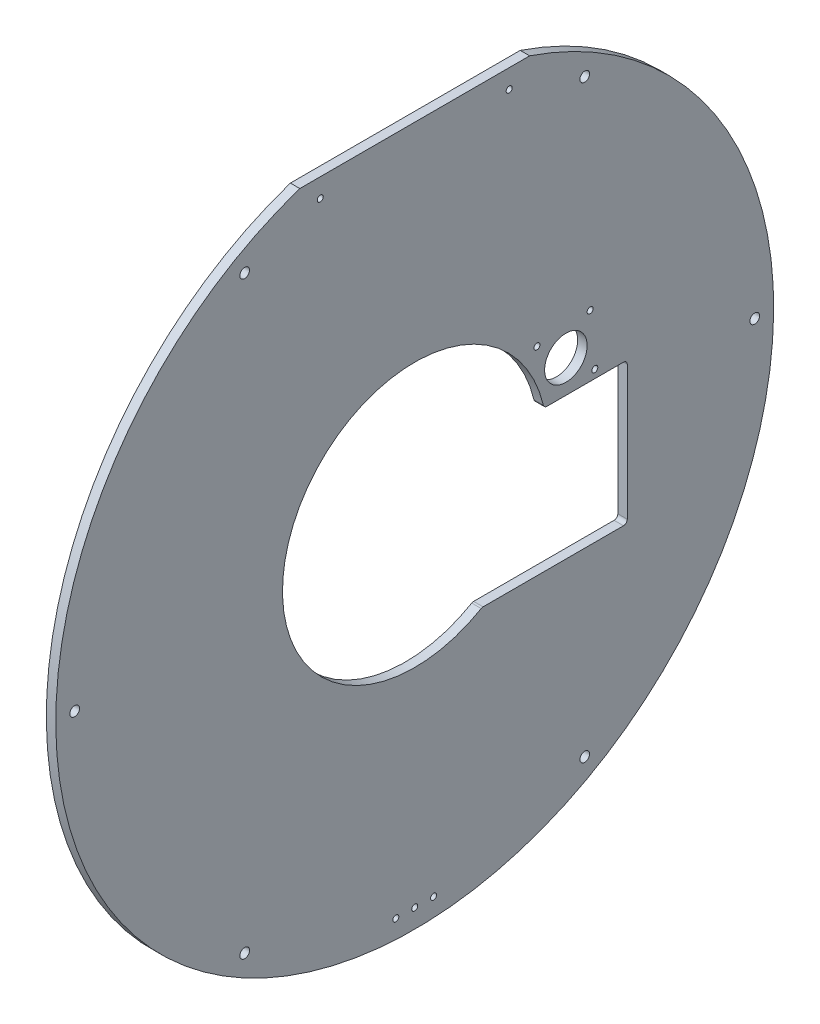
ISO-10303-21;
HEADER;
FILE_DESCRIPTION(('STEP AP214'),'2;1');
FILE_NAME('part.step','',(''),(''),'','','');
FILE_SCHEMA(('AUTOMOTIVE_DESIGN { 1 0 10303 214 1 1 1 1 }'));
ENDSEC;
DATA;
#1=APPLICATION_CONTEXT('core data for automotive mechanical design processes');
#2=APPLICATION_PROTOCOL_DEFINITION('international standard','automotive_design',2000,#1);
#3=PRODUCT_CONTEXT('',#1,'mechanical');
#4=PRODUCT('Part','Part','',(#3));
#5=PRODUCT_RELATED_PRODUCT_CATEGORY('part','',(#4));
#6=PRODUCT_DEFINITION_FORMATION('','',#4);
#7=PRODUCT_DEFINITION_CONTEXT('part definition',#1,'design');
#8=PRODUCT_DEFINITION('design','',#6,#7);
#9=PRODUCT_DEFINITION_SHAPE('','',#8);
#10=(LENGTH_UNIT() NAMED_UNIT(*) SI_UNIT(.MILLI.,.METRE.));
#11=(NAMED_UNIT(*) PLANE_ANGLE_UNIT() SI_UNIT($,.RADIAN.));
#12=(NAMED_UNIT(*) SI_UNIT($,.STERADIAN.) SOLID_ANGLE_UNIT());
#13=UNCERTAINTY_MEASURE_WITH_UNIT(LENGTH_MEASURE(1.E-05),#10,'distance_accuracy_value','');
#14=(GEOMETRIC_REPRESENTATION_CONTEXT(3) GLOBAL_UNCERTAINTY_ASSIGNED_CONTEXT((#13)) GLOBAL_UNIT_ASSIGNED_CONTEXT((#10,
#11,#12)) REPRESENTATION_CONTEXT('',''));
#15=CARTESIAN_POINT('',(0.,0.,0.));
#16=DIRECTION('',(0.,0.,1.));
#17=DIRECTION('',(1.,0.,0.));
#18=AXIS2_PLACEMENT_3D('',#15,#16,#17);
#19=CARTESIAN_POINT('',(6.35,228.6,0.));
#20=DIRECTION('',(0.,1.,0.));
#21=DIRECTION('',(0.,0.,1.));
#22=AXIS2_PLACEMENT_3D('',#19,#20,#21);
#23=PLANE('',#22);
#24=DIRECTION('',(0.,0.,-1.));
#25=VECTOR('',#24,1.);
#26=CARTESIAN_POINT('',(0.,228.6,0.));
#27=LINE('',#26,#25);
#28=CARTESIAN_POINT('',(0.,228.6,77.2510841347874));
#29=VERTEX_POINT('',#28);
#30=CARTESIAN_POINT('',(0.,228.6,-77.2510841347874));
#31=VERTEX_POINT('',#30);
#32=EDGE_CURVE('E124',#29,#31,#27,.T.);
#33=ORIENTED_EDGE('',*,*,#32,.F.);
#34=DIRECTION('',(-1.,0.,0.));
#35=VECTOR('',#34,1.);
#36=CARTESIAN_POINT('',(6.35,228.6,77.2510841347874));
#37=LINE('',#36,#35);
#38=CARTESIAN_POINT('',(6.35,228.6,77.2510841347874));
#39=VERTEX_POINT('',#38);
#40=EDGE_CURVE('E119',#39,#29,#37,.T.);
#41=ORIENTED_EDGE('',*,*,#40,.F.);
#42=DIRECTION('',(0.,0.,-1.));
#43=VECTOR('',#42,1.);
#44=CARTESIAN_POINT('',(6.35,228.6,0.));
#45=LINE('',#44,#43);
#46=CARTESIAN_POINT('',(6.35,228.6,-77.2510841347874));
#47=VERTEX_POINT('',#46);
#48=EDGE_CURVE('E122',#39,#47,#45,.T.);
#49=ORIENTED_EDGE('',*,*,#48,.T.);
#50=DIRECTION('',(-1.,0.,0.));
#51=VECTOR('',#50,1.);
#52=CARTESIAN_POINT('',(6.35,228.6,-77.2510841347874));
#53=LINE('',#52,#51);
#54=EDGE_CURVE('E130',#47,#31,#53,.T.);
#55=ORIENTED_EDGE('',*,*,#54,.T.);
#56=EDGE_LOOP('',(#33,#41,#49,#55));
#57=FACE_BOUND('',#56,.T.);
#58=ADVANCED_FACE('F41',(#57),#23,.T.);
#59=CARTESIAN_POINT('',(6.35,0.,0.));
#60=DIRECTION('',(-1.,0.,0.));
#61=DIRECTION('',(0.,0.,1.));
#62=AXIS2_PLACEMENT_3D('',#59,#60,#61);
#63=CYLINDRICAL_SURFACE('',#62,88.9);
#64=CARTESIAN_POINT('',(0.,0.,0.));
#65=DIRECTION('',(1.,0.,0.));
#66=DIRECTION('',(0.,0.,-1.));
#67=AXIS2_PLACEMENT_3D('',#64,#65,#66);
#68=CIRCLE('',#67,88.9);
#69=CARTESIAN_POINT('',(0.,20.6767772537497,-86.4620198838705));
#70=VERTEX_POINT('',#69);
#71=CARTESIAN_POINT('',(0.,-76.8662783018058,-44.6630189309828));
#72=VERTEX_POINT('',#71);
#73=EDGE_CURVE('E208',#70,#72,#68,.T.);
#74=ORIENTED_EDGE('',*,*,#73,.F.);
#75=DIRECTION('',(-1.,0.,0.));
#76=VECTOR('',#75,1.);
#77=CARTESIAN_POINT('',(6.35,20.6767772537497,-86.4620198838705));
#78=LINE('',#77,#76);
#79=CARTESIAN_POINT('',(6.35,20.6767772537497,-86.4620198838705));
#80=VERTEX_POINT('',#79);
#81=EDGE_CURVE('E252',#70,#80,#78,.F.);
#82=ORIENTED_EDGE('',*,*,#81,.T.);
#83=CARTESIAN_POINT('',(6.35,0.,0.));
#84=DIRECTION('',(1.,0.,0.));
#85=DIRECTION('',(0.,0.,-1.));
#86=AXIS2_PLACEMENT_3D('',#83,#84,#85);
#87=CIRCLE('',#86,88.9);
#88=CARTESIAN_POINT('',(6.35,-76.8662783018058,-44.6630189309828));
#89=VERTEX_POINT('',#88);
#90=EDGE_CURVE('E303',#80,#89,#87,.T.);
#91=ORIENTED_EDGE('',*,*,#90,.T.);
#92=DIRECTION('',(-1.,0.,0.));
#93=VECTOR('',#92,1.);
#94=CARTESIAN_POINT('',(6.35,-76.8662783018058,-44.6630189309828));
#95=LINE('',#94,#93);
#96=EDGE_CURVE('E248',#89,#72,#95,.T.);
#97=ORIENTED_EDGE('',*,*,#96,.T.);
#98=EDGE_LOOP('',(#74,#82,#91,#97));
#99=FACE_BOUND('',#98,.T.);
#100=ADVANCED_FACE('F301',(#99),#63,.F.);
#101=CARTESIAN_POINT('',(6.35,18.7275423181426,0.));
#102=DIRECTION('',(0.,1.,0.));
#103=DIRECTION('',(0.,0.,1.));
#104=AXIS2_PLACEMENT_3D('',#101,#102,#103);
#105=PLANE('',#104);
#106=DIRECTION('',(0.,0.,-1.));
#107=VECTOR('',#106,1.);
#108=CARTESIAN_POINT('',(6.35,18.7275423181426,0.));
#109=LINE('',#108,#107);
#110=CARTESIAN_POINT('',(6.35,18.7275423181426,-88.9323633091239));
#111=VERTEX_POINT('',#110);
#112=CARTESIAN_POINT('',(6.35,18.7275423181426,-140.335));
#113=VERTEX_POINT('',#112);
#114=EDGE_CURVE('E313',#111,#113,#109,.T.);
#115=ORIENTED_EDGE('',*,*,#114,.F.);
#116=DIRECTION('',(1.,0.,0.));
#117=VECTOR('',#116,1.);
#118=CARTESIAN_POINT('',(0.,18.7275423181426,-88.9323633091239));
#119=LINE('',#118,#117);
#120=CARTESIAN_POINT('',(0.,18.7275423181426,-88.9323633091239));
#121=VERTEX_POINT('',#120);
#122=EDGE_CURVE('E238',#111,#121,#119,.F.);
#123=ORIENTED_EDGE('',*,*,#122,.T.);
#124=DIRECTION('',(0.,0.,-1.));
#125=VECTOR('',#124,1.);
#126=CARTESIAN_POINT('',(0.,18.7275423181426,0.));
#127=LINE('',#126,#125);
#128=CARTESIAN_POINT('',(0.,18.7275423181426,-140.335));
#129=VERTEX_POINT('',#128);
#130=EDGE_CURVE('E212',#121,#129,#127,.T.);
#131=ORIENTED_EDGE('',*,*,#130,.T.);
#132=DIRECTION('',(-1.,0.,0.));
#133=VECTOR('',#132,1.);
#134=CARTESIAN_POINT('',(6.35,18.7275423181426,-140.335));
#135=LINE('',#134,#133);
#136=EDGE_CURVE('E129',#129,#113,#135,.F.);
#137=ORIENTED_EDGE('',*,*,#136,.T.);
#138=EDGE_LOOP('',(#115,#123,#131,#137));
#139=FACE_BOUND('',#138,.T.);
#140=ADVANCED_FACE('F310',(#139),#105,.F.);
#141=CARTESIAN_POINT('',(6.35,0.,-142.875));
#142=DIRECTION('',(0.,0.,-1.));
#143=DIRECTION('',(0.,1.,0.));
#144=AXIS2_PLACEMENT_3D('',#141,#142,#143);
#145=PLANE('',#144);
#146=DIRECTION('',(0.,-1.,0.));
#147=VECTOR('',#146,1.);
#148=CARTESIAN_POINT('',(6.35,0.,-142.875));
#149=LINE('',#148,#147);
#150=CARTESIAN_POINT('',(6.35,16.1875423181426,-142.875));
#151=VERTEX_POINT('',#150);
#152=CARTESIAN_POINT('',(6.35,-73.9824576818574,-142.875));
#153=VERTEX_POINT('',#152);
#154=EDGE_CURVE('E145',#151,#153,#149,.T.);
#155=ORIENTED_EDGE('',*,*,#154,.F.);
#156=DIRECTION('',(-1.,0.,0.));
#157=VECTOR('',#156,1.);
#158=CARTESIAN_POINT('',(0.,16.1875423181426,-142.875));
#159=LINE('',#158,#157);
#160=CARTESIAN_POINT('',(0.,16.1875423181426,-142.875));
#161=VERTEX_POINT('',#160);
#162=EDGE_CURVE('E264',#151,#161,#159,.T.);
#163=ORIENTED_EDGE('',*,*,#162,.T.);
#164=DIRECTION('',(0.,-1.,0.));
#165=VECTOR('',#164,1.);
#166=CARTESIAN_POINT('',(0.,0.,-142.875));
#167=LINE('',#166,#165);
#168=CARTESIAN_POINT('',(0.,-73.9824576818574,-142.875));
#169=VERTEX_POINT('',#168);
#170=EDGE_CURVE('E216',#161,#169,#167,.T.);
#171=ORIENTED_EDGE('',*,*,#170,.T.);
#172=DIRECTION('',(-1.,0.,0.));
#173=VECTOR('',#172,1.);
#174=CARTESIAN_POINT('',(6.35,-73.9824576818574,-142.875));
#175=LINE('',#174,#173);
#176=EDGE_CURVE('E261',#169,#153,#175,.F.);
#177=ORIENTED_EDGE('',*,*,#176,.T.);
#178=EDGE_LOOP('',(#155,#163,#171,#177));
#179=FACE_BOUND('',#178,.T.);
#180=ADVANCED_FACE('F290',(#179),#145,.F.);
#181=CARTESIAN_POINT('',(6.35,0.,0.));
#182=DIRECTION('',(-1.,0.,0.));
#183=DIRECTION('',(0.,0.,1.));
#184=AXIS2_PLACEMENT_3D('',#181,#182,#183);
#185=CYLINDRICAL_SURFACE('',#184,241.3);
#186=CARTESIAN_POINT('',(0.,0.,0.));
#187=DIRECTION('',(1.,0.,0.));
#188=DIRECTION('',(0.,0.,-1.));
#189=AXIS2_PLACEMENT_3D('',#186,#187,#188);
#190=CIRCLE('',#189,241.3);
#191=EDGE_CURVE('E226',#29,#31,#190,.T.);
#192=ORIENTED_EDGE('',*,*,#191,.T.);
#193=ORIENTED_EDGE('',*,*,#54,.F.);
#194=CARTESIAN_POINT('',(6.35,0.,0.));
#195=DIRECTION('',(1.,0.,0.));
#196=DIRECTION('',(0.,0.,-1.));
#197=AXIS2_PLACEMENT_3D('',#194,#195,#196);
#198=CIRCLE('',#197,241.3);
#199=EDGE_CURVE('E133',#39,#47,#198,.T.);
#200=ORIENTED_EDGE('',*,*,#199,.F.);
#201=ORIENTED_EDGE('',*,*,#40,.T.);
#202=EDGE_LOOP('',(#192,#193,#200,#201));
#203=FACE_BOUND('',#202,.T.);
#204=ADVANCED_FACE('F134',(#203),#185,.T.);
#205=CARTESIAN_POINT('',(6.35,-76.5224576818574,0.));
#206=DIRECTION('',(0.,1.,0.));
#207=DIRECTION('',(0.,0.,1.));
#208=AXIS2_PLACEMENT_3D('',#205,#206,#207);
#209=PLANE('',#208);
#210=DIRECTION('',(0.,0.,-1.));
#211=VECTOR('',#210,1.);
#212=CARTESIAN_POINT('',(6.35,-76.5224576818574,0.));
#213=LINE('',#212,#211);
#214=CARTESIAN_POINT('',(6.35,-76.5224576818574,-45.9391051861538));
#215=VERTEX_POINT('',#214);
#216=CARTESIAN_POINT('',(6.35,-76.5224576818574,-140.335));
#217=VERTEX_POINT('',#216);
#218=EDGE_CURVE('E142',#215,#217,#213,.T.);
#219=ORIENTED_EDGE('',*,*,#218,.T.);
#220=DIRECTION('',(-1.,0.,0.));
#221=VECTOR('',#220,1.);
#222=CARTESIAN_POINT('',(6.35,-76.5224576818574,-140.335));
#223=LINE('',#222,#221);
#224=CARTESIAN_POINT('',(0.,-76.5224576818574,-140.335));
#225=VERTEX_POINT('',#224);
#226=EDGE_CURVE('E270',#217,#225,#223,.T.);
#227=ORIENTED_EDGE('',*,*,#226,.T.);
#228=DIRECTION('',(0.,0.,-1.));
#229=VECTOR('',#228,1.);
#230=CARTESIAN_POINT('',(0.,-76.5224576818574,0.));
#231=LINE('',#230,#229);
#232=CARTESIAN_POINT('',(0.,-76.5224576818574,-45.9391051861538));
#233=VERTEX_POINT('',#232);
#234=EDGE_CURVE('E220',#233,#225,#231,.T.);
#235=ORIENTED_EDGE('',*,*,#234,.F.);
#236=DIRECTION('',(-1.,0.,0.));
#237=VECTOR('',#236,1.);
#238=CARTESIAN_POINT('',(6.35,-76.5224576818574,-45.9391051861538));
#239=LINE('',#238,#237);
#240=EDGE_CURVE('E62',#233,#215,#239,.F.);
#241=ORIENTED_EDGE('',*,*,#240,.T.);
#242=EDGE_LOOP('',(#219,#227,#235,#241));
#243=FACE_BOUND('',#242,.T.);
#244=ADVANCED_FACE('F293',(#243),#209,.T.);
#245=CARTESIAN_POINT('',(6.35,0.,228.6));
#246=DIRECTION('',(-1.,0.,0.));
#247=DIRECTION('',(0.,0.,1.));
#248=AXIS2_PLACEMENT_3D('',#245,#246,#247);
#249=CYLINDRICAL_SURFACE('',#248,3.26390000000001);
#250=CARTESIAN_POINT('',(6.35,0.,228.6));
#251=DIRECTION('',(1.,0.,0.));
#252=DIRECTION('',(0.,0.,-1.));
#253=AXIS2_PLACEMENT_3D('',#250,#251,#252);
#254=CIRCLE('',#253,3.26390000000001);
#255=CARTESIAN_POINT('',(6.35,0.,225.3361));
#256=VERTEX_POINT('',#255);
#257=EDGE_CURVE('E319',#256,#256,#254,.T.);
#258=ORIENTED_EDGE('',*,*,#257,.T.);
#259=EDGE_LOOP('',(#258));
#260=FACE_BOUND('',#259,.T.);
#261=CARTESIAN_POINT('',(0.,0.,228.6));
#262=DIRECTION('',(1.,0.,0.));
#263=DIRECTION('',(0.,0.,-1.));
#264=AXIS2_PLACEMENT_3D('',#261,#262,#263);
#265=CIRCLE('',#264,3.26390000000001);
#266=CARTESIAN_POINT('',(0.,0.,225.3361));
#267=VERTEX_POINT('',#266);
#268=EDGE_CURVE('E204',#267,#267,#265,.T.);
#269=ORIENTED_EDGE('',*,*,#268,.F.);
#270=EDGE_LOOP('',(#269));
#271=FACE_BOUND('',#270,.T.);
#272=ADVANCED_FACE('F410',(#260,#271),#249,.F.);
#273=CARTESIAN_POINT('',(6.35,197.973407305123,114.3));
#274=DIRECTION('',(-1.,0.,0.));
#275=DIRECTION('',(0.,0.,1.));
#276=AXIS2_PLACEMENT_3D('',#273,#274,#275);
#277=CYLINDRICAL_SURFACE('',#276,3.26390000000002);
#278=CARTESIAN_POINT('',(6.35,197.973407305123,114.3));
#279=DIRECTION('',(1.,0.,0.));
#280=DIRECTION('',(0.,0.,-1.));
#281=AXIS2_PLACEMENT_3D('',#278,#279,#280);
#282=CIRCLE('',#281,3.26390000000002);
#283=CARTESIAN_POINT('',(6.35,197.973407305123,111.0361));
#284=VERTEX_POINT('',#283);
#285=EDGE_CURVE('E325',#284,#284,#282,.T.);
#286=ORIENTED_EDGE('',*,*,#285,.T.);
#287=EDGE_LOOP('',(#286));
#288=FACE_BOUND('',#287,.T.);
#289=CARTESIAN_POINT('',(0.,197.973407305123,114.3));
#290=DIRECTION('',(1.,0.,0.));
#291=DIRECTION('',(0.,0.,-1.));
#292=AXIS2_PLACEMENT_3D('',#289,#290,#291);
#293=CIRCLE('',#292,3.26390000000002);
#294=CARTESIAN_POINT('',(0.,197.973407305123,111.0361));
#295=VERTEX_POINT('',#294);
#296=EDGE_CURVE('E200',#295,#295,#293,.T.);
#297=ORIENTED_EDGE('',*,*,#296,.F.);
#298=EDGE_LOOP('',(#297));
#299=FACE_BOUND('',#298,.T.);
#300=ADVANCED_FACE('F413',(#288,#299),#277,.F.);
#301=CARTESIAN_POINT('',(6.35,197.973407305122,-114.300000000001));
#302=DIRECTION('',(-1.,0.,0.));
#303=DIRECTION('',(0.,0.,1.));
#304=AXIS2_PLACEMENT_3D('',#301,#302,#303);
#305=CYLINDRICAL_SURFACE('',#304,3.2639);
#306=CARTESIAN_POINT('',(6.35,197.973407305122,-114.300000000001));
#307=DIRECTION('',(1.,0.,0.));
#308=DIRECTION('',(0.,0.,-1.));
#309=AXIS2_PLACEMENT_3D('',#306,#307,#308);
#310=CIRCLE('',#309,3.2639);
#311=CARTESIAN_POINT('',(6.35,197.973407305122,-117.563900000001));
#312=VERTEX_POINT('',#311);
#313=EDGE_CURVE('E329',#312,#312,#310,.T.);
#314=ORIENTED_EDGE('',*,*,#313,.T.);
#315=EDGE_LOOP('',(#314));
#316=FACE_BOUND('',#315,.T.);
#317=CARTESIAN_POINT('',(0.,197.973407305122,-114.300000000001));
#318=DIRECTION('',(1.,0.,0.));
#319=DIRECTION('',(0.,0.,-1.));
#320=AXIS2_PLACEMENT_3D('',#317,#318,#319);
#321=CIRCLE('',#320,3.2639);
#322=CARTESIAN_POINT('',(0.,197.973407305122,-117.563900000001));
#323=VERTEX_POINT('',#322);
#324=EDGE_CURVE('E196',#323,#323,#321,.T.);
#325=ORIENTED_EDGE('',*,*,#324,.F.);
#326=EDGE_LOOP('',(#325));
#327=FACE_BOUND('',#326,.T.);
#328=ADVANCED_FACE('F443',(#316,#327),#305,.F.);
#329=CARTESIAN_POINT('',(6.35,-1.59630526811908E-12,-228.6));
#330=DIRECTION('',(-1.,0.,0.));
#331=DIRECTION('',(0.,0.,1.));
#332=AXIS2_PLACEMENT_3D('',#329,#330,#331);
#333=CYLINDRICAL_SURFACE('',#332,3.2639);
#334=CARTESIAN_POINT('',(6.35,-1.59630526811908E-12,-228.6));
#335=DIRECTION('',(1.,0.,0.));
#336=DIRECTION('',(0.,0.,-1.));
#337=AXIS2_PLACEMENT_3D('',#334,#335,#336);
#338=CIRCLE('',#337,3.2639);
#339=CARTESIAN_POINT('',(6.35,-1.59630526811908E-12,-231.8639));
#340=VERTEX_POINT('',#339);
#341=EDGE_CURVE('E333',#340,#340,#338,.T.);
#342=ORIENTED_EDGE('',*,*,#341,.T.);
#343=EDGE_LOOP('',(#342));
#344=FACE_BOUND('',#343,.T.);
#345=CARTESIAN_POINT('',(0.,-1.59630526811908E-12,-228.6));
#346=DIRECTION('',(1.,0.,0.));
#347=DIRECTION('',(0.,0.,-1.));
#348=AXIS2_PLACEMENT_3D('',#345,#346,#347);
#349=CIRCLE('',#348,3.2639);
#350=CARTESIAN_POINT('',(0.,-1.59630526811908E-12,-231.8639));
#351=VERTEX_POINT('',#350);
#352=EDGE_CURVE('E192',#351,#351,#349,.T.);
#353=ORIENTED_EDGE('',*,*,#352,.F.);
#354=EDGE_LOOP('',(#353));
#355=FACE_BOUND('',#354,.T.);
#356=ADVANCED_FACE('F447',(#344,#355),#333,.F.);
#357=CARTESIAN_POINT('',(6.35,-197.973407305124,-114.299999999998));
#358=DIRECTION('',(-1.,0.,0.));
#359=DIRECTION('',(0.,0.,1.));
#360=AXIS2_PLACEMENT_3D('',#357,#358,#359);
#361=CYLINDRICAL_SURFACE('',#360,3.2639);
#362=CARTESIAN_POINT('',(6.35,-197.973407305124,-114.299999999998));
#363=DIRECTION('',(1.,0.,0.));
#364=DIRECTION('',(0.,0.,-1.));
#365=AXIS2_PLACEMENT_3D('',#362,#363,#364);
#366=CIRCLE('',#365,3.2639);
#367=CARTESIAN_POINT('',(6.35,-197.973407305124,-117.563899999998));
#368=VERTEX_POINT('',#367);
#369=EDGE_CURVE('E337',#368,#368,#366,.T.);
#370=ORIENTED_EDGE('',*,*,#369,.T.);
#371=EDGE_LOOP('',(#370));
#372=FACE_BOUND('',#371,.T.);
#373=CARTESIAN_POINT('',(0.,-197.973407305124,-114.299999999998));
#374=DIRECTION('',(1.,0.,0.));
#375=DIRECTION('',(0.,0.,-1.));
#376=AXIS2_PLACEMENT_3D('',#373,#374,#375);
#377=CIRCLE('',#376,3.2639);
#378=CARTESIAN_POINT('',(0.,-197.973407305124,-117.563899999998));
#379=VERTEX_POINT('',#378);
#380=EDGE_CURVE('E188',#379,#379,#377,.T.);
#381=ORIENTED_EDGE('',*,*,#380,.F.);
#382=EDGE_LOOP('',(#381));
#383=FACE_BOUND('',#382,.T.);
#384=ADVANCED_FACE('F451',(#372,#383),#361,.F.);
#385=CARTESIAN_POINT('',(6.35,-197.973407305121,114.300000000002));
#386=DIRECTION('',(-1.,0.,0.));
#387=DIRECTION('',(0.,0.,1.));
#388=AXIS2_PLACEMENT_3D('',#385,#386,#387);
#389=CYLINDRICAL_SURFACE('',#388,3.26390000000001);
#390=CARTESIAN_POINT('',(6.35,-197.973407305121,114.300000000002));
#391=DIRECTION('',(1.,0.,0.));
#392=DIRECTION('',(0.,0.,-1.));
#393=AXIS2_PLACEMENT_3D('',#390,#391,#392);
#394=CIRCLE('',#393,3.26390000000001);
#395=CARTESIAN_POINT('',(6.35,-197.973407305121,111.036100000002));
#396=VERTEX_POINT('',#395);
#397=EDGE_CURVE('E341',#396,#396,#394,.T.);
#398=ORIENTED_EDGE('',*,*,#397,.T.);
#399=EDGE_LOOP('',(#398));
#400=FACE_BOUND('',#399,.T.);
#401=CARTESIAN_POINT('',(0.,-197.973407305121,114.300000000002));
#402=DIRECTION('',(1.,0.,0.));
#403=DIRECTION('',(0.,0.,-1.));
#404=AXIS2_PLACEMENT_3D('',#401,#402,#403);
#405=CIRCLE('',#404,3.26390000000001);
#406=CARTESIAN_POINT('',(0.,-197.973407305121,111.036100000002));
#407=VERTEX_POINT('',#406);
#408=EDGE_CURVE('E184',#407,#407,#405,.T.);
#409=ORIENTED_EDGE('',*,*,#408,.F.);
#410=EDGE_LOOP('',(#409));
#411=FACE_BOUND('',#410,.T.);
#412=ADVANCED_FACE('F455',(#400,#411),#389,.F.);
#413=CARTESIAN_POINT('',(6.35,-228.6,0.));
#414=DIRECTION('',(-1.,0.,0.));
#415=DIRECTION('',(0.,0.,1.));
#416=AXIS2_PLACEMENT_3D('',#413,#414,#415);
#417=CYLINDRICAL_SURFACE('',#416,2.0193);
#418=CARTESIAN_POINT('',(6.35,-228.6,0.));
#419=DIRECTION('',(1.,0.,0.));
#420=DIRECTION('',(0.,0.,-1.));
#421=AXIS2_PLACEMENT_3D('',#418,#419,#420);
#422=CIRCLE('',#421,2.0193);
#423=CARTESIAN_POINT('',(6.35,-228.6,-2.0193));
#424=VERTEX_POINT('',#423);
#425=EDGE_CURVE('E345',#424,#424,#422,.T.);
#426=ORIENTED_EDGE('',*,*,#425,.T.);
#427=EDGE_LOOP('',(#426));
#428=FACE_BOUND('',#427,.T.);
#429=CARTESIAN_POINT('',(0.,-228.6,0.));
#430=DIRECTION('',(1.,0.,0.));
#431=DIRECTION('',(0.,0.,-1.));
#432=AXIS2_PLACEMENT_3D('',#429,#430,#431);
#433=CIRCLE('',#432,2.0193);
#434=CARTESIAN_POINT('',(0.,-228.6,-2.0193));
#435=VERTEX_POINT('',#434);
#436=EDGE_CURVE('E180',#435,#435,#433,.T.);
#437=ORIENTED_EDGE('',*,*,#436,.F.);
#438=EDGE_LOOP('',(#437));
#439=FACE_BOUND('',#438,.T.);
#440=ADVANCED_FACE('F459',(#428,#439),#417,.F.);
#441=CARTESIAN_POINT('',(6.35,-228.6,12.7));
#442=DIRECTION('',(-1.,0.,0.));
#443=DIRECTION('',(0.,0.,1.));
#444=AXIS2_PLACEMENT_3D('',#441,#442,#443);
#445=CYLINDRICAL_SURFACE('',#444,2.0193);
#446=CARTESIAN_POINT('',(6.35,-228.6,12.7));
#447=DIRECTION('',(1.,0.,0.));
#448=DIRECTION('',(0.,0.,-1.));
#449=AXIS2_PLACEMENT_3D('',#446,#447,#448);
#450=CIRCLE('',#449,2.0193);
#451=CARTESIAN_POINT('',(6.35,-228.6,10.6807));
#452=VERTEX_POINT('',#451);
#453=EDGE_CURVE('E349',#452,#452,#450,.T.);
#454=ORIENTED_EDGE('',*,*,#453,.T.);
#455=EDGE_LOOP('',(#454));
#456=FACE_BOUND('',#455,.T.);
#457=CARTESIAN_POINT('',(0.,-228.6,12.7));
#458=DIRECTION('',(1.,0.,0.));
#459=DIRECTION('',(0.,0.,-1.));
#460=AXIS2_PLACEMENT_3D('',#457,#458,#459);
#461=CIRCLE('',#460,2.0193);
#462=CARTESIAN_POINT('',(0.,-228.6,10.6807));
#463=VERTEX_POINT('',#462);
#464=EDGE_CURVE('E176',#463,#463,#461,.T.);
#465=ORIENTED_EDGE('',*,*,#464,.F.);
#466=EDGE_LOOP('',(#465));
#467=FACE_BOUND('',#466,.T.);
#468=ADVANCED_FACE('F463',(#456,#467),#445,.F.);
#469=CARTESIAN_POINT('',(6.35,215.9,63.5));
#470=DIRECTION('',(-1.,0.,0.));
#471=DIRECTION('',(0.,0.,1.));
#472=AXIS2_PLACEMENT_3D('',#469,#470,#471);
#473=CYLINDRICAL_SURFACE('',#472,2.0193);
#474=CARTESIAN_POINT('',(6.35,215.9,63.5));
#475=DIRECTION('',(1.,0.,0.));
#476=DIRECTION('',(0.,0.,-1.));
#477=AXIS2_PLACEMENT_3D('',#474,#475,#476);
#478=CIRCLE('',#477,2.0193);
#479=CARTESIAN_POINT('',(6.35,215.9,61.4807));
#480=VERTEX_POINT('',#479);
#481=EDGE_CURVE('E353',#480,#480,#478,.T.);
#482=ORIENTED_EDGE('',*,*,#481,.T.);
#483=EDGE_LOOP('',(#482));
#484=FACE_BOUND('',#483,.T.);
#485=CARTESIAN_POINT('',(0.,215.9,63.5));
#486=DIRECTION('',(1.,0.,0.));
#487=DIRECTION('',(0.,0.,-1.));
#488=AXIS2_PLACEMENT_3D('',#485,#486,#487);
#489=CIRCLE('',#488,2.0193);
#490=CARTESIAN_POINT('',(0.,215.9,61.4807));
#491=VERTEX_POINT('',#490);
#492=EDGE_CURVE('E172',#491,#491,#489,.T.);
#493=ORIENTED_EDGE('',*,*,#492,.F.);
#494=EDGE_LOOP('',(#493));
#495=FACE_BOUND('',#494,.T.);
#496=ADVANCED_FACE('F467',(#484,#495),#473,.F.);
#497=CARTESIAN_POINT('',(6.35,215.9,-63.5));
#498=DIRECTION('',(-1.,0.,0.));
#499=DIRECTION('',(0.,0.,1.));
#500=AXIS2_PLACEMENT_3D('',#497,#498,#499);
#501=CYLINDRICAL_SURFACE('',#500,2.0193);
#502=CARTESIAN_POINT('',(6.35,215.9,-63.5));
#503=DIRECTION('',(1.,0.,0.));
#504=DIRECTION('',(0.,0.,-1.));
#505=AXIS2_PLACEMENT_3D('',#502,#503,#504);
#506=CIRCLE('',#505,2.0193);
#507=CARTESIAN_POINT('',(6.35,215.9,-65.5193));
#508=VERTEX_POINT('',#507);
#509=EDGE_CURVE('E357',#508,#508,#506,.F.);
#510=ORIENTED_EDGE('',*,*,#509,.F.);
#511=EDGE_LOOP('',(#510));
#512=FACE_BOUND('',#511,.T.);
#513=CARTESIAN_POINT('',(0.,215.9,-63.5));
#514=DIRECTION('',(1.,0.,0.));
#515=DIRECTION('',(0.,0.,-1.));
#516=AXIS2_PLACEMENT_3D('',#513,#514,#515);
#517=CIRCLE('',#516,2.0193);
#518=CARTESIAN_POINT('',(0.,215.9,-65.5193));
#519=VERTEX_POINT('',#518);
#520=EDGE_CURVE('E168',#519,#519,#517,.F.);
#521=ORIENTED_EDGE('',*,*,#520,.T.);
#522=EDGE_LOOP('',(#521));
#523=FACE_BOUND('',#522,.T.);
#524=ADVANCED_FACE('F471',(#512,#523),#501,.F.);
#525=CARTESIAN_POINT('',(6.35,40.64,-101.6));
#526=DIRECTION('',(-1.,0.,0.));
#527=DIRECTION('',(0.,0.,1.));
#528=AXIS2_PLACEMENT_3D('',#525,#526,#527);
#529=CYLINDRICAL_SURFACE('',#528,14.2875);
#530=CARTESIAN_POINT('',(6.35,40.64,-101.6));
#531=DIRECTION('',(1.,0.,0.));
#532=DIRECTION('',(0.,0.,-1.));
#533=AXIS2_PLACEMENT_3D('',#530,#531,#532);
#534=CIRCLE('',#533,14.2875);
#535=CARTESIAN_POINT('',(6.35,40.64,-115.8875));
#536=VERTEX_POINT('',#535);
#537=EDGE_CURVE('E361',#536,#536,#534,.T.);
#538=ORIENTED_EDGE('',*,*,#537,.T.);
#539=EDGE_LOOP('',(#538));
#540=FACE_BOUND('',#539,.T.);
#541=CARTESIAN_POINT('',(0.,40.64,-101.6));
#542=DIRECTION('',(1.,0.,0.));
#543=DIRECTION('',(0.,0.,-1.));
#544=AXIS2_PLACEMENT_3D('',#541,#542,#543);
#545=CIRCLE('',#544,14.2875);
#546=CARTESIAN_POINT('',(0.,40.64,-115.8875));
#547=VERTEX_POINT('',#546);
#548=EDGE_CURVE('E164',#547,#547,#545,.T.);
#549=ORIENTED_EDGE('',*,*,#548,.F.);
#550=EDGE_LOOP('',(#549));
#551=FACE_BOUND('',#550,.T.);
#552=ADVANCED_FACE('F475',(#540,#551),#529,.F.);
#553=CARTESIAN_POINT('',(6.35,56.966805286038,-82.1424711447779));
#554=DIRECTION('',(-1.,0.,0.));
#555=DIRECTION('',(0.,0.,1.));
#556=AXIS2_PLACEMENT_3D('',#553,#554,#555);
#557=CYLINDRICAL_SURFACE('',#556,2.01930000000005);
#558=CARTESIAN_POINT('',(6.35,56.966805286038,-82.1424711447779));
#559=DIRECTION('',(1.,0.,0.));
#560=DIRECTION('',(0.,0.,-1.));
#561=AXIS2_PLACEMENT_3D('',#558,#559,#560);
#562=CIRCLE('',#561,2.01930000000005);
#563=CARTESIAN_POINT('',(6.35,56.966805286038,-84.1617711447779));
#564=VERTEX_POINT('',#563);
#565=EDGE_CURVE('E365',#564,#564,#562,.T.);
#566=ORIENTED_EDGE('',*,*,#565,.T.);
#567=EDGE_LOOP('',(#566));
#568=FACE_BOUND('',#567,.T.);
#569=CARTESIAN_POINT('',(0.,56.966805286038,-82.1424711447779));
#570=DIRECTION('',(1.,0.,0.));
#571=DIRECTION('',(0.,0.,-1.));
#572=AXIS2_PLACEMENT_3D('',#569,#570,#571);
#573=CIRCLE('',#572,2.01930000000005);
#574=CARTESIAN_POINT('',(0.,56.966805286038,-84.1617711447779));
#575=VERTEX_POINT('',#574);
#576=EDGE_CURVE('E160',#575,#575,#573,.T.);
#577=ORIENTED_EDGE('',*,*,#576,.F.);
#578=EDGE_LOOP('',(#577));
#579=FACE_BOUND('',#578,.T.);
#580=ADVANCED_FACE('F479',(#568,#579),#557,.F.);
#581=CARTESIAN_POINT('',(6.35,60.0975288552229,-117.926805286038));
#582=DIRECTION('',(-1.,0.,0.));
#583=DIRECTION('',(0.,0.,1.));
#584=AXIS2_PLACEMENT_3D('',#581,#582,#583);
#585=CYLINDRICAL_SURFACE('',#584,2.01930000000001);
#586=CARTESIAN_POINT('',(6.35,60.0975288552229,-117.926805286038));
#587=DIRECTION('',(1.,0.,0.));
#588=DIRECTION('',(0.,0.,-1.));
#589=AXIS2_PLACEMENT_3D('',#586,#587,#588);
#590=CIRCLE('',#589,2.01930000000001);
#591=CARTESIAN_POINT('',(6.35,60.0975288552229,-119.946105286038));
#592=VERTEX_POINT('',#591);
#593=EDGE_CURVE('E369',#592,#592,#590,.T.);
#594=ORIENTED_EDGE('',*,*,#593,.T.);
#595=EDGE_LOOP('',(#594));
#596=FACE_BOUND('',#595,.T.);
#597=CARTESIAN_POINT('',(0.,60.0975288552229,-117.926805286038));
#598=DIRECTION('',(1.,0.,0.));
#599=DIRECTION('',(0.,0.,-1.));
#600=AXIS2_PLACEMENT_3D('',#597,#598,#599);
#601=CIRCLE('',#600,2.01930000000001);
#602=CARTESIAN_POINT('',(0.,60.0975288552229,-119.946105286038));
#603=VERTEX_POINT('',#602);
#604=EDGE_CURVE('E156',#603,#603,#601,.T.);
#605=ORIENTED_EDGE('',*,*,#604,.F.);
#606=EDGE_LOOP('',(#605));
#607=FACE_BOUND('',#606,.T.);
#608=ADVANCED_FACE('F483',(#596,#607),#585,.F.);
#609=CARTESIAN_POINT('',(6.35,24.3131947139628,-121.057528855223));
#610=DIRECTION('',(-1.,0.,0.));
#611=DIRECTION('',(0.,0.,1.));
#612=AXIS2_PLACEMENT_3D('',#609,#610,#611);
#613=CYLINDRICAL_SURFACE('',#612,2.01930000000002);
#614=CARTESIAN_POINT('',(6.35,24.3131947139628,-121.057528855223));
#615=DIRECTION('',(1.,0.,0.));
#616=DIRECTION('',(0.,0.,-1.));
#617=AXIS2_PLACEMENT_3D('',#614,#615,#616);
#618=CIRCLE('',#617,2.01930000000002);
#619=CARTESIAN_POINT('',(6.35,24.3131947139628,-123.076828855223));
#620=VERTEX_POINT('',#619);
#621=EDGE_CURVE('E233',#620,#620,#618,.T.);
#622=ORIENTED_EDGE('',*,*,#621,.T.);
#623=EDGE_LOOP('',(#622));
#624=FACE_BOUND('',#623,.T.);
#625=CARTESIAN_POINT('',(0.,24.3131947139628,-121.057528855223));
#626=DIRECTION('',(1.,0.,0.));
#627=DIRECTION('',(0.,0.,-1.));
#628=AXIS2_PLACEMENT_3D('',#625,#626,#627);
#629=CIRCLE('',#628,2.01930000000002);
#630=CARTESIAN_POINT('',(0.,24.3131947139628,-123.076828855223));
#631=VERTEX_POINT('',#630);
#632=EDGE_CURVE('E152',#631,#631,#629,.T.);
#633=ORIENTED_EDGE('',*,*,#632,.F.);
#634=EDGE_LOOP('',(#633));
#635=FACE_BOUND('',#634,.T.);
#636=ADVANCED_FACE('F377',(#624,#635),#613,.F.);
#637=CARTESIAN_POINT('',(6.35,-228.6,-12.7));
#638=DIRECTION('',(-1.,0.,0.));
#639=DIRECTION('',(0.,0.,1.));
#640=AXIS2_PLACEMENT_3D('',#637,#638,#639);
#641=CYLINDRICAL_SURFACE('',#640,2.0193);
#642=CARTESIAN_POINT('',(6.35,-228.6,-12.7));
#643=DIRECTION('',(1.,0.,0.));
#644=DIRECTION('',(0.,0.,-1.));
#645=AXIS2_PLACEMENT_3D('',#642,#643,#644);
#646=CIRCLE('',#645,2.0193);
#647=CARTESIAN_POINT('',(6.35,-228.6,-14.7193));
#648=VERTEX_POINT('',#647);
#649=EDGE_CURVE('E137',#648,#648,#646,.F.);
#650=ORIENTED_EDGE('',*,*,#649,.F.);
#651=EDGE_LOOP('',(#650));
#652=FACE_BOUND('',#651,.T.);
#653=CARTESIAN_POINT('',(0.,-228.6,-12.7));
#654=DIRECTION('',(1.,0.,0.));
#655=DIRECTION('',(0.,0.,-1.));
#656=AXIS2_PLACEMENT_3D('',#653,#654,#655);
#657=CIRCLE('',#656,2.0193);
#658=CARTESIAN_POINT('',(0.,-228.6,-14.7193));
#659=VERTEX_POINT('',#658);
#660=EDGE_CURVE('E229',#659,#659,#657,.F.);
#661=ORIENTED_EDGE('',*,*,#660,.T.);
#662=EDGE_LOOP('',(#661));
#663=FACE_BOUND('',#662,.T.);
#664=ADVANCED_FACE('F382',(#652,#663),#641,.F.);
#665=CARTESIAN_POINT('',(6.35,0.,0.));
#666=DIRECTION('',(1.,0.,0.));
#667=DIRECTION('',(0.,0.,-1.));
#668=AXIS2_PLACEMENT_3D('',#665,#666,#667);
#669=PLANE('',#668);
#670=ORIENTED_EDGE('',*,*,#621,.F.);
#671=EDGE_LOOP('',(#670));
#672=FACE_BOUND('',#671,.T.);
#673=ORIENTED_EDGE('',*,*,#593,.F.);
#674=EDGE_LOOP('',(#673));
#675=FACE_BOUND('',#674,.T.);
#676=ORIENTED_EDGE('',*,*,#565,.F.);
#677=EDGE_LOOP('',(#676));
#678=FACE_BOUND('',#677,.T.);
#679=ORIENTED_EDGE('',*,*,#537,.F.);
#680=EDGE_LOOP('',(#679));
#681=FACE_BOUND('',#680,.T.);
#682=ORIENTED_EDGE('',*,*,#509,.T.);
#683=EDGE_LOOP('',(#682));
#684=FACE_BOUND('',#683,.T.);
#685=ORIENTED_EDGE('',*,*,#481,.F.);
#686=EDGE_LOOP('',(#685));
#687=FACE_BOUND('',#686,.T.);
#688=ORIENTED_EDGE('',*,*,#453,.F.);
#689=EDGE_LOOP('',(#688));
#690=FACE_BOUND('',#689,.T.);
#691=ORIENTED_EDGE('',*,*,#425,.F.);
#692=EDGE_LOOP('',(#691));
#693=FACE_BOUND('',#692,.T.);
#694=ORIENTED_EDGE('',*,*,#397,.F.);
#695=EDGE_LOOP('',(#694));
#696=FACE_BOUND('',#695,.T.);
#697=ORIENTED_EDGE('',*,*,#369,.F.);
#698=EDGE_LOOP('',(#697));
#699=FACE_BOUND('',#698,.T.);
#700=ORIENTED_EDGE('',*,*,#341,.F.);
#701=EDGE_LOOP('',(#700));
#702=FACE_BOUND('',#701,.T.);
#703=ORIENTED_EDGE('',*,*,#313,.F.);
#704=EDGE_LOOP('',(#703));
#705=FACE_BOUND('',#704,.T.);
#706=ORIENTED_EDGE('',*,*,#285,.F.);
#707=EDGE_LOOP('',(#706));
#708=FACE_BOUND('',#707,.T.);
#709=ORIENTED_EDGE('',*,*,#257,.F.);
#710=EDGE_LOOP('',(#709));
#711=FACE_BOUND('',#710,.T.);
#712=ORIENTED_EDGE('',*,*,#90,.F.);
#713=CARTESIAN_POINT('',(6.35,21.2675423181426,-88.9323633091239));
#714=DIRECTION('',(1.,0.,0.));
#715=DIRECTION('',(0.,0.,-1.));
#716=AXIS2_PLACEMENT_3D('',#713,#714,#715);
#717=CIRCLE('',#716,2.54);
#718=EDGE_CURVE('E258',#80,#111,#717,.T.);
#719=ORIENTED_EDGE('',*,*,#718,.T.);
#720=ORIENTED_EDGE('',*,*,#114,.T.);
#721=CARTESIAN_POINT('',(6.35,16.1875423181426,-140.335));
#722=DIRECTION('',(1.,0.,0.));
#723=DIRECTION('',(0.,0.,-1.));
#724=AXIS2_PLACEMENT_3D('',#721,#722,#723);
#725=CIRCLE('',#724,2.54);
#726=EDGE_CURVE('E277',#113,#151,#725,.F.);
#727=ORIENTED_EDGE('',*,*,#726,.T.);
#728=ORIENTED_EDGE('',*,*,#154,.T.);
#729=CARTESIAN_POINT('',(6.35,-73.9824576818574,-140.335));
#730=DIRECTION('',(1.,0.,0.));
#731=DIRECTION('',(0.,0.,-1.));
#732=AXIS2_PLACEMENT_3D('',#729,#730,#731);
#733=CIRCLE('',#732,2.54);
#734=EDGE_CURVE('E11',#153,#217,#733,.F.);
#735=ORIENTED_EDGE('',*,*,#734,.T.);
#736=ORIENTED_EDGE('',*,*,#218,.F.);
#737=CARTESIAN_POINT('',(6.35,-79.0624576818574,-45.9391051861538));
#738=DIRECTION('',(1.,0.,0.));
#739=DIRECTION('',(0.,0.,-1.));
#740=AXIS2_PLACEMENT_3D('',#737,#738,#739);
#741=CIRCLE('',#740,2.54);
#742=EDGE_CURVE('E255',#215,#89,#741,.T.);
#743=ORIENTED_EDGE('',*,*,#742,.T.);
#744=EDGE_LOOP('',(#712,#719,#720,#727,#728,#735,#736,#743));
#745=FACE_BOUND('',#744,.T.);
#746=ORIENTED_EDGE('',*,*,#48,.F.);
#747=ORIENTED_EDGE('',*,*,#199,.T.);
#748=EDGE_LOOP('',(#746,#747));
#749=FACE_BOUND('',#748,.T.);
#750=ORIENTED_EDGE('',*,*,#649,.T.);
#751=EDGE_LOOP('',(#750));
#752=FACE_BOUND('',#751,.T.);
#753=ADVANCED_FACE('F139',(#672,#675,#678,#681,#684,#687,#690,#693,#696,#699,#702,#705,#708,
#711,#745,#749,#752),#669,.T.);
#754=CARTESIAN_POINT('',(0.,0.,0.));
#755=DIRECTION('',(1.,0.,0.));
#756=DIRECTION('',(0.,0.,-1.));
#757=AXIS2_PLACEMENT_3D('',#754,#755,#756);
#758=PLANE('',#757);
#759=ORIENTED_EDGE('',*,*,#632,.T.);
#760=EDGE_LOOP('',(#759));
#761=FACE_BOUND('',#760,.T.);
#762=ORIENTED_EDGE('',*,*,#604,.T.);
#763=EDGE_LOOP('',(#762));
#764=FACE_BOUND('',#763,.T.);
#765=ORIENTED_EDGE('',*,*,#576,.T.);
#766=EDGE_LOOP('',(#765));
#767=FACE_BOUND('',#766,.T.);
#768=ORIENTED_EDGE('',*,*,#548,.T.);
#769=EDGE_LOOP('',(#768));
#770=FACE_BOUND('',#769,.T.);
#771=ORIENTED_EDGE('',*,*,#520,.F.);
#772=EDGE_LOOP('',(#771));
#773=FACE_BOUND('',#772,.T.);
#774=ORIENTED_EDGE('',*,*,#492,.T.);
#775=EDGE_LOOP('',(#774));
#776=FACE_BOUND('',#775,.T.);
#777=ORIENTED_EDGE('',*,*,#464,.T.);
#778=EDGE_LOOP('',(#777));
#779=FACE_BOUND('',#778,.T.);
#780=ORIENTED_EDGE('',*,*,#436,.T.);
#781=EDGE_LOOP('',(#780));
#782=FACE_BOUND('',#781,.T.);
#783=ORIENTED_EDGE('',*,*,#408,.T.);
#784=EDGE_LOOP('',(#783));
#785=FACE_BOUND('',#784,.T.);
#786=ORIENTED_EDGE('',*,*,#380,.T.);
#787=EDGE_LOOP('',(#786));
#788=FACE_BOUND('',#787,.T.);
#789=ORIENTED_EDGE('',*,*,#352,.T.);
#790=EDGE_LOOP('',(#789));
#791=FACE_BOUND('',#790,.T.);
#792=ORIENTED_EDGE('',*,*,#324,.T.);
#793=EDGE_LOOP('',(#792));
#794=FACE_BOUND('',#793,.T.);
#795=ORIENTED_EDGE('',*,*,#296,.T.);
#796=EDGE_LOOP('',(#795));
#797=FACE_BOUND('',#796,.T.);
#798=ORIENTED_EDGE('',*,*,#268,.T.);
#799=EDGE_LOOP('',(#798));
#800=FACE_BOUND('',#799,.T.);
#801=ORIENTED_EDGE('',*,*,#130,.F.);
#802=CARTESIAN_POINT('',(0.,21.2675423181426,-88.9323633091239));
#803=DIRECTION('',(1.,0.,0.));
#804=DIRECTION('',(0.,0.,-1.));
#805=AXIS2_PLACEMENT_3D('',#802,#803,#804);
#806=CIRCLE('',#805,2.54);
#807=EDGE_CURVE('E245',#121,#70,#806,.F.);
#808=ORIENTED_EDGE('',*,*,#807,.T.);
#809=ORIENTED_EDGE('',*,*,#73,.T.);
#810=CARTESIAN_POINT('',(0.,-79.0624576818574,-45.9391051861538));
#811=DIRECTION('',(1.,0.,0.));
#812=DIRECTION('',(0.,0.,-1.));
#813=AXIS2_PLACEMENT_3D('',#810,#811,#812);
#814=CIRCLE('',#813,2.54);
#815=EDGE_CURVE('E242',#72,#233,#814,.F.);
#816=ORIENTED_EDGE('',*,*,#815,.T.);
#817=ORIENTED_EDGE('',*,*,#234,.T.);
#818=CARTESIAN_POINT('',(0.,-73.9824576818574,-140.335));
#819=DIRECTION('',(1.,0.,0.));
#820=DIRECTION('',(0.,0.,-1.));
#821=AXIS2_PLACEMENT_3D('',#818,#819,#820);
#822=CIRCLE('',#821,2.54);
#823=EDGE_CURVE('E50',#225,#169,#822,.T.);
#824=ORIENTED_EDGE('',*,*,#823,.T.);
#825=ORIENTED_EDGE('',*,*,#170,.F.);
#826=CARTESIAN_POINT('',(0.,16.1875423181426,-140.335));
#827=DIRECTION('',(1.,0.,0.));
#828=DIRECTION('',(0.,0.,-1.));
#829=AXIS2_PLACEMENT_3D('',#826,#827,#828);
#830=CIRCLE('',#829,2.54);
#831=EDGE_CURVE('E274',#161,#129,#830,.T.);
#832=ORIENTED_EDGE('',*,*,#831,.T.);
#833=EDGE_LOOP('',(#801,#808,#809,#816,#817,#824,#825,#832));
#834=FACE_BOUND('',#833,.T.);
#835=ORIENTED_EDGE('',*,*,#32,.T.);
#836=ORIENTED_EDGE('',*,*,#191,.F.);
#837=EDGE_LOOP('',(#835,#836));
#838=FACE_BOUND('',#837,.T.);
#839=ORIENTED_EDGE('',*,*,#660,.F.);
#840=EDGE_LOOP('',(#839));
#841=FACE_BOUND('',#840,.T.);
#842=ADVANCED_FACE('F283',(#761,#764,#767,#770,#773,#776,#779,#782,#785,#788,#791,#794,#797,
#800,#834,#838,#841),#758,.F.);
#843=CARTESIAN_POINT('',(6.35,21.2675423181426,-88.9323633091239));
#844=DIRECTION('',(-1.,0.,0.));
#845=DIRECTION('',(0.,0.,1.));
#846=AXIS2_PLACEMENT_3D('',#843,#844,#845);
#847=CYLINDRICAL_SURFACE('',#846,2.54);
#848=ORIENTED_EDGE('',*,*,#718,.F.);
#849=ORIENTED_EDGE('',*,*,#81,.F.);
#850=ORIENTED_EDGE('',*,*,#807,.F.);
#851=ORIENTED_EDGE('',*,*,#122,.F.);
#852=EDGE_LOOP('',(#848,#849,#850,#851));
#853=FACE_BOUND('',#852,.T.);
#854=ADVANCED_FACE('F307',(#853),#847,.T.);
#855=CARTESIAN_POINT('',(6.35,16.1875423181426,-140.335));
#856=DIRECTION('',(1.,0.,0.));
#857=DIRECTION('',(0.,0.,-1.));
#858=AXIS2_PLACEMENT_3D('',#855,#856,#857);
#859=CYLINDRICAL_SURFACE('',#858,2.54);
#860=ORIENTED_EDGE('',*,*,#726,.F.);
#861=ORIENTED_EDGE('',*,*,#136,.F.);
#862=ORIENTED_EDGE('',*,*,#831,.F.);
#863=ORIENTED_EDGE('',*,*,#162,.F.);
#864=EDGE_LOOP('',(#860,#861,#862,#863));
#865=FACE_BOUND('',#864,.T.);
#866=ADVANCED_FACE('F423',(#865),#859,.F.);
#867=CARTESIAN_POINT('',(6.35,-73.9824576818574,-140.335));
#868=DIRECTION('',(-1.,0.,0.));
#869=DIRECTION('',(0.,0.,1.));
#870=AXIS2_PLACEMENT_3D('',#867,#868,#869);
#871=CYLINDRICAL_SURFACE('',#870,2.54);
#872=ORIENTED_EDGE('',*,*,#734,.F.);
#873=ORIENTED_EDGE('',*,*,#176,.F.);
#874=ORIENTED_EDGE('',*,*,#823,.F.);
#875=ORIENTED_EDGE('',*,*,#226,.F.);
#876=EDGE_LOOP('',(#872,#873,#874,#875));
#877=FACE_BOUND('',#876,.T.);
#878=ADVANCED_FACE('F292',(#877),#871,.F.);
#879=CARTESIAN_POINT('',(6.35,-79.0624576818574,-45.9391051861538));
#880=DIRECTION('',(-1.,0.,0.));
#881=DIRECTION('',(0.,0.,1.));
#882=AXIS2_PLACEMENT_3D('',#879,#880,#881);
#883=CYLINDRICAL_SURFACE('',#882,2.54);
#884=ORIENTED_EDGE('',*,*,#742,.F.);
#885=ORIENTED_EDGE('',*,*,#240,.F.);
#886=ORIENTED_EDGE('',*,*,#815,.F.);
#887=ORIENTED_EDGE('',*,*,#96,.F.);
#888=EDGE_LOOP('',(#884,#885,#886,#887));
#889=FACE_BOUND('',#888,.T.);
#890=ADVANCED_FACE('F43',(#889),#883,.T.);
#891=CLOSED_SHELL('',(#58,#100,#140,#180,#204,#244,#272,#300,#328,#356,#384,#412,#440,#468,#496,
#524,#552,#580,#608,#636,#664,#753,#842,#854,#866,#878,#890));
#892=MANIFOLD_SOLID_BREP('B2',#891);
#893=ADVANCED_BREP_SHAPE_REPRESENTATION('',(#18,#892),#14);
#894=SHAPE_DEFINITION_REPRESENTATION(#9,#893);
ENDSEC;
END-ISO-10303-21;
